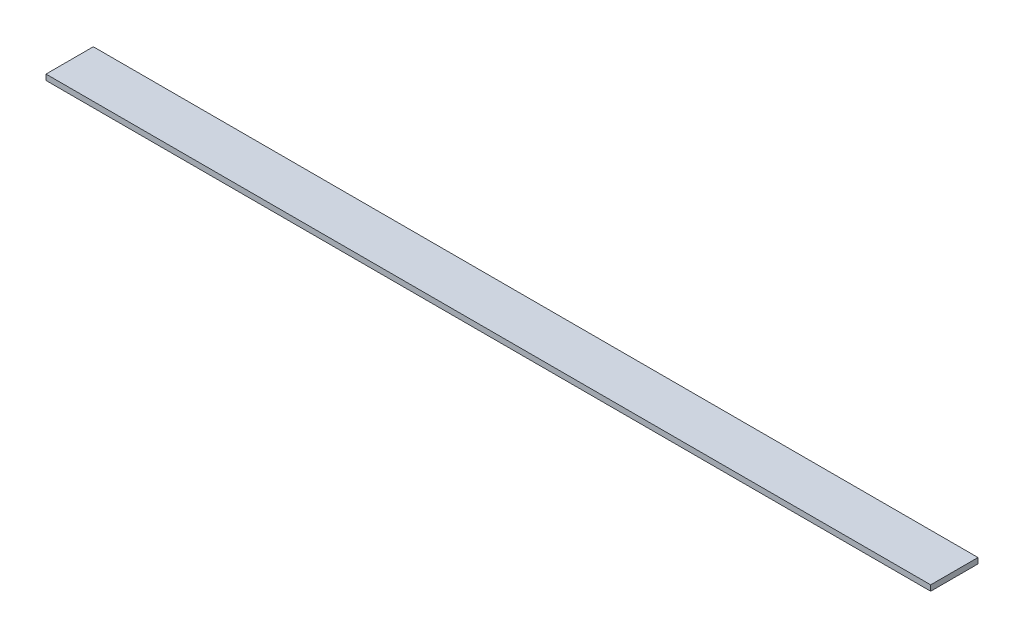
ISO-10303-21;
HEADER;
FILE_DESCRIPTION(('STEP AP214'),'2;1');
FILE_NAME('part.step','',(''),(''),'','','');
FILE_SCHEMA(('AUTOMOTIVE_DESIGN { 1 0 10303 214 1 1 1 1 }'));
ENDSEC;
DATA;
#1=APPLICATION_CONTEXT('core data for automotive mechanical design processes');
#2=APPLICATION_PROTOCOL_DEFINITION('international standard','automotive_design',2000,#1);
#3=PRODUCT_CONTEXT('',#1,'mechanical');
#4=PRODUCT('Part','Part','',(#3));
#5=PRODUCT_RELATED_PRODUCT_CATEGORY('part','',(#4));
#6=PRODUCT_DEFINITION_FORMATION('','',#4);
#7=PRODUCT_DEFINITION_CONTEXT('part definition',#1,'design');
#8=PRODUCT_DEFINITION('design','',#6,#7);
#9=PRODUCT_DEFINITION_SHAPE('','',#8);
#10=(LENGTH_UNIT() NAMED_UNIT(*) SI_UNIT(.MILLI.,.METRE.));
#11=(NAMED_UNIT(*) PLANE_ANGLE_UNIT() SI_UNIT($,.RADIAN.));
#12=(NAMED_UNIT(*) SI_UNIT($,.STERADIAN.) SOLID_ANGLE_UNIT());
#13=UNCERTAINTY_MEASURE_WITH_UNIT(LENGTH_MEASURE(1.E-05),#10,'distance_accuracy_value','');
#14=(GEOMETRIC_REPRESENTATION_CONTEXT(3) GLOBAL_UNCERTAINTY_ASSIGNED_CONTEXT((#13)) GLOBAL_UNIT_ASSIGNED_CONTEXT((#10,
#11,#12)) REPRESENTATION_CONTEXT('',''));
#15=CARTESIAN_POINT('',(0.,0.,0.));
#16=DIRECTION('',(0.,0.,1.));
#17=DIRECTION('',(1.,0.,0.));
#18=AXIS2_PLACEMENT_3D('',#15,#16,#17);
#19=CARTESIAN_POINT('',(32.8748727593644,337.925662841851,-45.3172803248969));
#20=DIRECTION('',(0.,0.,-1.));
#21=DIRECTION('',(-1.,0.,0.));
#22=AXIS2_PLACEMENT_3D('',#19,#20,#21);
#23=PLANE('',#22);
#24=DIRECTION('',(1.,0.,0.));
#25=VECTOR('',#24,1.);
#26=CARTESIAN_POINT('',(32.8748727593644,334.925662841851,-45.3172803248969));
#27=LINE('',#26,#25);
#28=CARTESIAN_POINT('',(32.8748727593644,334.925662841851,-45.3172803248969));
#29=VERTEX_POINT('',#28);
#30=CARTESIAN_POINT('',(507.724872759365,334.925662841851,-45.3172803248968));
#31=VERTEX_POINT('',#30);
#32=EDGE_CURVE('E101',#29,#31,#27,.T.);
#33=ORIENTED_EDGE('',*,*,#32,.T.);
#34=DIRECTION('',(0.,-1.,0.));
#35=VECTOR('',#34,1.);
#36=CARTESIAN_POINT('',(507.724872759365,337.925662841851,-45.3172803248968));
#37=LINE('',#36,#35);
#38=CARTESIAN_POINT('',(507.724872759365,337.925662841851,-45.3172803248968));
#39=VERTEX_POINT('',#38);
#40=EDGE_CURVE('E11',#39,#31,#37,.T.);
#41=ORIENTED_EDGE('',*,*,#40,.F.);
#42=DIRECTION('',(1.,0.,0.));
#43=VECTOR('',#42,1.);
#44=CARTESIAN_POINT('',(32.8748727593644,337.925662841851,-45.3172803248969));
#45=LINE('',#44,#43);
#46=CARTESIAN_POINT('',(32.8748727593644,337.925662841851,-45.3172803248969));
#47=VERTEX_POINT('',#46);
#48=EDGE_CURVE('E78',#47,#39,#45,.T.);
#49=ORIENTED_EDGE('',*,*,#48,.F.);
#50=DIRECTION('',(0.,-1.,0.));
#51=VECTOR('',#50,1.);
#52=CARTESIAN_POINT('',(32.8748727593644,337.925662841851,-45.3172803248969));
#53=LINE('',#52,#51);
#54=EDGE_CURVE('E97',#47,#29,#53,.T.);
#55=ORIENTED_EDGE('',*,*,#54,.T.);
#56=EDGE_LOOP('',(#33,#41,#49,#55));
#57=FACE_BOUND('',#56,.T.);
#58=ADVANCED_FACE('F39',(#57),#23,.F.);
#59=CARTESIAN_POINT('',(507.724872759365,337.925662841851,-70.7172803248969));
#60=DIRECTION('',(1.,0.,0.));
#61=DIRECTION('',(0.,0.,-1.));
#62=AXIS2_PLACEMENT_3D('',#59,#60,#61);
#63=PLANE('',#62);
#64=DIRECTION('',(0.,0.,1.));
#65=VECTOR('',#64,1.);
#66=CARTESIAN_POINT('',(507.724872759365,334.925662841851,-70.7172803248969));
#67=LINE('',#66,#65);
#68=CARTESIAN_POINT('',(507.724872759365,334.925662841851,-70.7172803248969));
#69=VERTEX_POINT('',#68);
#70=EDGE_CURVE('E87',#69,#31,#67,.T.);
#71=ORIENTED_EDGE('',*,*,#70,.F.);
#72=DIRECTION('',(0.,-1.,0.));
#73=VECTOR('',#72,1.);
#74=CARTESIAN_POINT('',(507.724872759365,337.925662841851,-70.7172803248969));
#75=LINE('',#74,#73);
#76=CARTESIAN_POINT('',(507.724872759365,337.925662841851,-70.7172803248969));
#77=VERTEX_POINT('',#76);
#78=EDGE_CURVE('E47',#77,#69,#75,.T.);
#79=ORIENTED_EDGE('',*,*,#78,.F.);
#80=DIRECTION('',(0.,0.,1.));
#81=VECTOR('',#80,1.);
#82=CARTESIAN_POINT('',(507.724872759365,337.925662841851,-70.7172803248969));
#83=LINE('',#82,#81);
#84=EDGE_CURVE('E85',#77,#39,#83,.T.);
#85=ORIENTED_EDGE('',*,*,#84,.T.);
#86=ORIENTED_EDGE('',*,*,#40,.T.);
#87=EDGE_LOOP('',(#71,#79,#85,#86));
#88=FACE_BOUND('',#87,.T.);
#89=ADVANCED_FACE('F84',(#88),#63,.T.);
#90=CARTESIAN_POINT('',(32.8748727593644,337.925662841851,-70.7172803248969));
#91=DIRECTION('',(0.,0.,-1.));
#92=DIRECTION('',(-1.,0.,0.));
#93=AXIS2_PLACEMENT_3D('',#90,#91,#92);
#94=PLANE('',#93);
#95=DIRECTION('',(1.,0.,0.));
#96=VECTOR('',#95,1.);
#97=CARTESIAN_POINT('',(32.8748727593644,334.925662841851,-70.7172803248969));
#98=LINE('',#97,#96);
#99=CARTESIAN_POINT('',(32.8748727593644,334.925662841851,-70.7172803248969));
#100=VERTEX_POINT('',#99);
#101=EDGE_CURVE('E105',#100,#69,#98,.T.);
#102=ORIENTED_EDGE('',*,*,#101,.F.);
#103=DIRECTION('',(0.,-1.,0.));
#104=VECTOR('',#103,1.);
#105=CARTESIAN_POINT('',(32.8748727593644,337.925662841851,-70.7172803248969));
#106=LINE('',#105,#104);
#107=CARTESIAN_POINT('',(32.8748727593644,337.925662841851,-70.7172803248969));
#108=VERTEX_POINT('',#107);
#109=EDGE_CURVE('E70',#108,#100,#106,.T.);
#110=ORIENTED_EDGE('',*,*,#109,.F.);
#111=DIRECTION('',(1.,0.,0.));
#112=VECTOR('',#111,1.);
#113=CARTESIAN_POINT('',(32.8748727593644,337.925662841851,-70.7172803248969));
#114=LINE('',#113,#112);
#115=EDGE_CURVE('E93',#108,#77,#114,.T.);
#116=ORIENTED_EDGE('',*,*,#115,.T.);
#117=ORIENTED_EDGE('',*,*,#78,.T.);
#118=EDGE_LOOP('',(#102,#110,#116,#117));
#119=FACE_BOUND('',#118,.T.);
#120=ADVANCED_FACE('F95',(#119),#94,.T.);
#121=CARTESIAN_POINT('',(32.8748727593644,337.925662841851,-70.7172803248969));
#122=DIRECTION('',(1.,0.,0.));
#123=DIRECTION('',(0.,0.,-1.));
#124=AXIS2_PLACEMENT_3D('',#121,#122,#123);
#125=PLANE('',#124);
#126=DIRECTION('',(0.,0.,1.));
#127=VECTOR('',#126,1.);
#128=CARTESIAN_POINT('',(32.8748727593644,334.925662841851,-70.7172803248969));
#129=LINE('',#128,#127);
#130=EDGE_CURVE('E73',#100,#29,#129,.T.);
#131=ORIENTED_EDGE('',*,*,#130,.T.);
#132=ORIENTED_EDGE('',*,*,#54,.F.);
#133=DIRECTION('',(0.,0.,1.));
#134=VECTOR('',#133,1.);
#135=CARTESIAN_POINT('',(32.8748727593644,337.925662841851,-70.7172803248969));
#136=LINE('',#135,#134);
#137=EDGE_CURVE('E55',#108,#47,#136,.T.);
#138=ORIENTED_EDGE('',*,*,#137,.F.);
#139=ORIENTED_EDGE('',*,*,#109,.T.);
#140=EDGE_LOOP('',(#131,#132,#138,#139));
#141=FACE_BOUND('',#140,.T.);
#142=ADVANCED_FACE('F118',(#141),#125,.F.);
#143=CARTESIAN_POINT('',(0.,337.925662841851,0.));
#144=DIRECTION('',(0.,-1.,0.));
#145=DIRECTION('',(0.,0.,-1.));
#146=AXIS2_PLACEMENT_3D('',#143,#144,#145);
#147=PLANE('',#146);
#148=ORIENTED_EDGE('',*,*,#48,.T.);
#149=ORIENTED_EDGE('',*,*,#84,.F.);
#150=ORIENTED_EDGE('',*,*,#115,.F.);
#151=ORIENTED_EDGE('',*,*,#137,.T.);
#152=EDGE_LOOP('',(#148,#149,#150,#151));
#153=FACE_BOUND('',#152,.T.);
#154=ADVANCED_FACE('F92',(#153),#147,.F.);
#155=CARTESIAN_POINT('',(0.,334.925662841851,0.));
#156=DIRECTION('',(0.,-1.,0.));
#157=DIRECTION('',(0.,0.,-1.));
#158=AXIS2_PLACEMENT_3D('',#155,#156,#157);
#159=PLANE('',#158);
#160=ORIENTED_EDGE('',*,*,#32,.F.);
#161=ORIENTED_EDGE('',*,*,#130,.F.);
#162=ORIENTED_EDGE('',*,*,#101,.T.);
#163=ORIENTED_EDGE('',*,*,#70,.T.);
#164=EDGE_LOOP('',(#160,#161,#162,#163));
#165=FACE_BOUND('',#164,.T.);
#166=ADVANCED_FACE('F112',(#165),#159,.T.);
#167=CLOSED_SHELL('',(#58,#89,#120,#142,#154,#166));
#168=MANIFOLD_SOLID_BREP('B2',#167);
#169=ADVANCED_BREP_SHAPE_REPRESENTATION('',(#18,#168),#14);
#170=SHAPE_DEFINITION_REPRESENTATION(#9,#169);
ENDSEC;
END-ISO-10303-21;
